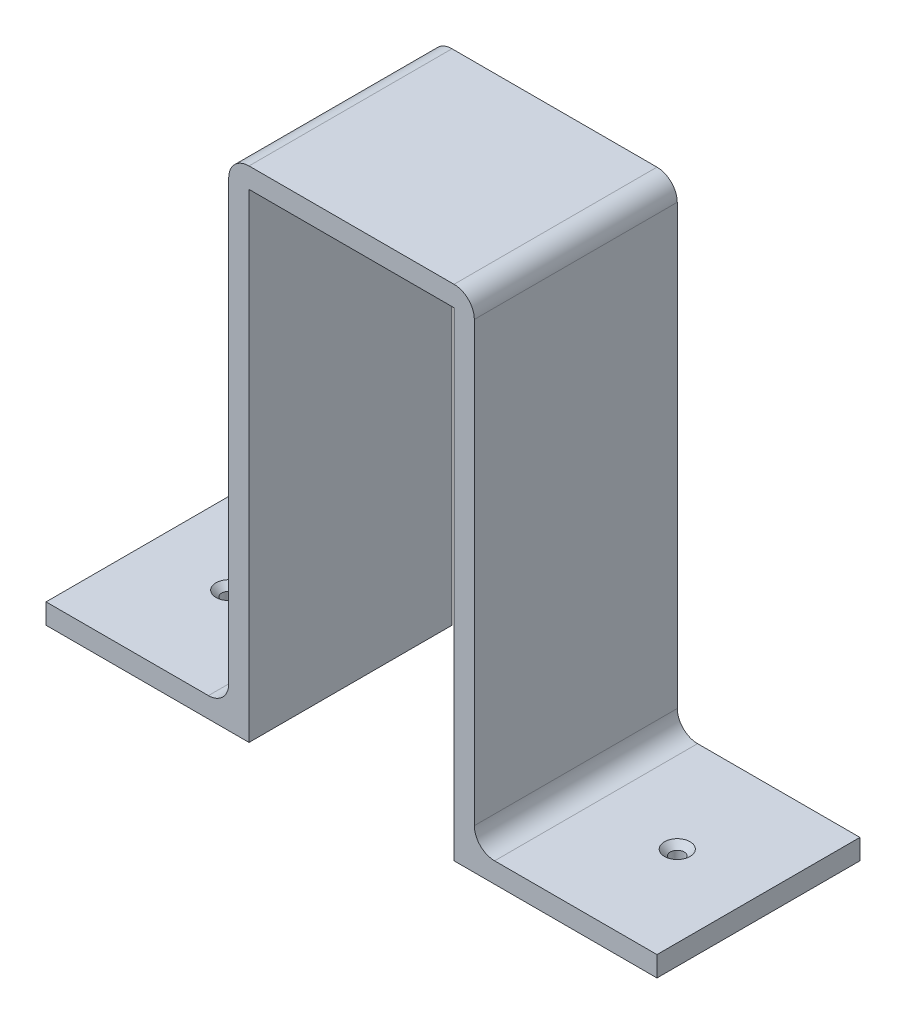
ISO-10303-21;
HEADER;
FILE_DESCRIPTION(('STEP AP214'),'2;1');
FILE_NAME('part.step','',(''),(''),'','','');
FILE_SCHEMA(('AUTOMOTIVE_DESIGN { 1 0 10303 214 1 1 1 1 }'));
ENDSEC;
DATA;
#1=APPLICATION_CONTEXT('core data for automotive mechanical design processes');
#2=APPLICATION_PROTOCOL_DEFINITION('international standard','automotive_design',2000,#1);
#3=PRODUCT_CONTEXT('',#1,'mechanical');
#4=PRODUCT('Part','Part','',(#3));
#5=PRODUCT_RELATED_PRODUCT_CATEGORY('part','',(#4));
#6=PRODUCT_DEFINITION_FORMATION('','',#4);
#7=PRODUCT_DEFINITION_CONTEXT('part definition',#1,'design');
#8=PRODUCT_DEFINITION('design','',#6,#7);
#9=PRODUCT_DEFINITION_SHAPE('','',#8);
#10=(LENGTH_UNIT() NAMED_UNIT(*) SI_UNIT(.MILLI.,.METRE.));
#11=(NAMED_UNIT(*) PLANE_ANGLE_UNIT() SI_UNIT($,.RADIAN.));
#12=(NAMED_UNIT(*) SI_UNIT($,.STERADIAN.) SOLID_ANGLE_UNIT());
#13=UNCERTAINTY_MEASURE_WITH_UNIT(LENGTH_MEASURE(1.E-05),#10,'distance_accuracy_value','');
#14=(GEOMETRIC_REPRESENTATION_CONTEXT(3) GLOBAL_UNCERTAINTY_ASSIGNED_CONTEXT((#13)) GLOBAL_UNIT_ASSIGNED_CONTEXT((#10,
#11,#12)) REPRESENTATION_CONTEXT('',''));
#15=CARTESIAN_POINT('',(0.,0.,0.));
#16=DIRECTION('',(0.,0.,1.));
#17=DIRECTION('',(1.,0.,0.));
#18=AXIS2_PLACEMENT_3D('',#15,#16,#17);
#19=CARTESIAN_POINT('',(-25.25,-118.,50.));
#20=DIRECTION('',(0.,1.,0.));
#21=DIRECTION('',(0.,0.,1.));
#22=AXIS2_PLACEMENT_3D('',#19,#20,#21);
#23=PLANE('',#22);
#24=CARTESIAN_POINT('',(-55.25,-118.,25.));
#25=DIRECTION('',(0.,1.,0.));
#26=DIRECTION('',(0.,0.,1.));
#27=AXIS2_PLACEMENT_3D('',#24,#25,#26);
#28=CIRCLE('',#27,1.7);
#29=CARTESIAN_POINT('',(-55.25,-118.,26.7));
#30=VERTEX_POINT('',#29);
#31=EDGE_CURVE('E309',#30,#30,#28,.T.);
#32=ORIENTED_EDGE('',*,*,#31,.T.);
#33=EDGE_LOOP('',(#32));
#34=FACE_BOUND('',#33,.T.);
#35=DIRECTION('',(1.,0.,0.));
#36=VECTOR('',#35,1.);
#37=CARTESIAN_POINT('',(-25.25,-118.,0.));
#38=LINE('',#37,#36);
#39=CARTESIAN_POINT('',(-75.25,-118.,0.));
#40=VERTEX_POINT('',#39);
#41=CARTESIAN_POINT('',(-25.25,-118.,0.));
#42=VERTEX_POINT('',#41);
#43=EDGE_CURVE('E169',#40,#42,#38,.T.);
#44=ORIENTED_EDGE('',*,*,#43,.T.);
#45=DIRECTION('',(0.,0.,-1.));
#46=VECTOR('',#45,1.);
#47=CARTESIAN_POINT('',(-25.25,-118.,50.));
#48=LINE('',#47,#46);
#49=CARTESIAN_POINT('',(-25.25,-118.,50.));
#50=VERTEX_POINT('',#49);
#51=EDGE_CURVE('E151',#50,#42,#48,.T.);
#52=ORIENTED_EDGE('',*,*,#51,.F.);
#53=DIRECTION('',(1.,0.,0.));
#54=VECTOR('',#53,1.);
#55=CARTESIAN_POINT('',(-25.25,-118.,50.));
#56=LINE('',#55,#54);
#57=CARTESIAN_POINT('',(-75.25,-118.,50.));
#58=VERTEX_POINT('',#57);
#59=EDGE_CURVE('E157',#58,#50,#56,.T.);
#60=ORIENTED_EDGE('',*,*,#59,.F.);
#61=DIRECTION('',(0.,0.,-1.));
#62=VECTOR('',#61,1.);
#63=CARTESIAN_POINT('',(-75.25,-118.,50.));
#64=LINE('',#63,#62);
#65=EDGE_CURVE('E247',#58,#40,#64,.T.);
#66=ORIENTED_EDGE('',*,*,#65,.T.);
#67=EDGE_LOOP('',(#44,#52,#60,#66));
#68=FACE_BOUND('',#67,.T.);
#69=ADVANCED_FACE('F33',(#34,#68),#23,.F.);
#70=CARTESIAN_POINT('',(-25.25,0.,50.));
#71=DIRECTION('',(-1.,0.,0.));
#72=DIRECTION('',(0.,-1.,0.));
#73=AXIS2_PLACEMENT_3D('',#70,#71,#72);
#74=PLANE('',#73);
#75=DIRECTION('',(0.,1.,0.));
#76=VECTOR('',#75,1.);
#77=CARTESIAN_POINT('',(-25.25,0.,0.));
#78=LINE('',#77,#76);
#79=CARTESIAN_POINT('',(-25.25,0.,0.));
#80=VERTEX_POINT('',#79);
#81=EDGE_CURVE('E249',#42,#80,#78,.T.);
#82=ORIENTED_EDGE('',*,*,#81,.T.);
#83=DIRECTION('',(0.,0.,-1.));
#84=VECTOR('',#83,1.);
#85=CARTESIAN_POINT('',(-25.25,0.,50.));
#86=LINE('',#85,#84);
#87=CARTESIAN_POINT('',(-25.25,0.,50.));
#88=VERTEX_POINT('',#87);
#89=EDGE_CURVE('E154',#88,#80,#86,.T.);
#90=ORIENTED_EDGE('',*,*,#89,.F.);
#91=DIRECTION('',(0.,1.,0.));
#92=VECTOR('',#91,1.);
#93=CARTESIAN_POINT('',(-25.25,0.,50.));
#94=LINE('',#93,#92);
#95=EDGE_CURVE('E147',#50,#88,#94,.T.);
#96=ORIENTED_EDGE('',*,*,#95,.F.);
#97=ORIENTED_EDGE('',*,*,#51,.T.);
#98=EDGE_LOOP('',(#82,#90,#96,#97));
#99=FACE_BOUND('',#98,.T.);
#100=ADVANCED_FACE('F149',(#99),#74,.F.);
#101=CARTESIAN_POINT('',(-25.25,0.,50.));
#102=DIRECTION('',(0.,1.,0.));
#103=DIRECTION('',(0.,0.,1.));
#104=AXIS2_PLACEMENT_3D('',#101,#102,#103);
#105=PLANE('',#104);
#106=DIRECTION('',(1.,0.,0.));
#107=VECTOR('',#106,1.);
#108=CARTESIAN_POINT('',(-25.25,0.,0.));
#109=LINE('',#108,#107);
#110=CARTESIAN_POINT('',(25.25,0.,0.));
#111=VERTEX_POINT('',#110);
#112=EDGE_CURVE('E252',#80,#111,#109,.T.);
#113=ORIENTED_EDGE('',*,*,#112,.T.);
#114=DIRECTION('',(0.,0.,-1.));
#115=VECTOR('',#114,1.);
#116=CARTESIAN_POINT('',(25.25,0.,50.));
#117=LINE('',#116,#115);
#118=CARTESIAN_POINT('',(25.25,0.,50.));
#119=VERTEX_POINT('',#118);
#120=EDGE_CURVE('E175',#119,#111,#117,.T.);
#121=ORIENTED_EDGE('',*,*,#120,.F.);
#122=DIRECTION('',(1.,0.,0.));
#123=VECTOR('',#122,1.);
#124=CARTESIAN_POINT('',(-25.25,0.,50.));
#125=LINE('',#124,#123);
#126=EDGE_CURVE('E156',#88,#119,#125,.T.);
#127=ORIENTED_EDGE('',*,*,#126,.F.);
#128=ORIENTED_EDGE('',*,*,#89,.T.);
#129=EDGE_LOOP('',(#113,#121,#127,#128));
#130=FACE_BOUND('',#129,.T.);
#131=ADVANCED_FACE('F359',(#130),#105,.F.);
#132=CARTESIAN_POINT('',(25.25,0.,50.));
#133=DIRECTION('',(1.,0.,0.));
#134=DIRECTION('',(0.,1.,0.));
#135=AXIS2_PLACEMENT_3D('',#132,#133,#134);
#136=PLANE('',#135);
#137=DIRECTION('',(0.,-1.,0.));
#138=VECTOR('',#137,1.);
#139=CARTESIAN_POINT('',(25.25,0.,0.));
#140=LINE('',#139,#138);
#141=CARTESIAN_POINT('',(25.25,-118.,0.));
#142=VERTEX_POINT('',#141);
#143=EDGE_CURVE('E254',#111,#142,#140,.T.);
#144=ORIENTED_EDGE('',*,*,#143,.T.);
#145=DIRECTION('',(0.,0.,-1.));
#146=VECTOR('',#145,1.);
#147=CARTESIAN_POINT('',(25.25,-118.,50.));
#148=LINE('',#147,#146);
#149=CARTESIAN_POINT('',(25.25,-118.,50.));
#150=VERTEX_POINT('',#149);
#151=EDGE_CURVE('E276',#150,#142,#148,.T.);
#152=ORIENTED_EDGE('',*,*,#151,.F.);
#153=DIRECTION('',(0.,-1.,0.));
#154=VECTOR('',#153,1.);
#155=CARTESIAN_POINT('',(25.25,0.,50.));
#156=LINE('',#155,#154);
#157=EDGE_CURVE('E285',#119,#150,#156,.T.);
#158=ORIENTED_EDGE('',*,*,#157,.F.);
#159=ORIENTED_EDGE('',*,*,#120,.T.);
#160=EDGE_LOOP('',(#144,#152,#158,#159));
#161=FACE_BOUND('',#160,.T.);
#162=ADVANCED_FACE('F283',(#161),#136,.F.);
#163=CARTESIAN_POINT('',(25.25,-118.,50.));
#164=DIRECTION('',(0.,1.,0.));
#165=DIRECTION('',(0.,0.,1.));
#166=AXIS2_PLACEMENT_3D('',#163,#164,#165);
#167=PLANE('',#166);
#168=CARTESIAN_POINT('',(55.25,-118.,25.));
#169=DIRECTION('',(0.,1.,0.));
#170=DIRECTION('',(0.,0.,1.));
#171=AXIS2_PLACEMENT_3D('',#168,#169,#170);
#172=CIRCLE('',#171,1.7);
#173=CARTESIAN_POINT('',(55.25,-118.,26.7));
#174=VERTEX_POINT('',#173);
#175=EDGE_CURVE('E250',#174,#174,#172,.T.);
#176=ORIENTED_EDGE('',*,*,#175,.T.);
#177=EDGE_LOOP('',(#176));
#178=FACE_BOUND('',#177,.T.);
#179=DIRECTION('',(1.,0.,0.));
#180=VECTOR('',#179,1.);
#181=CARTESIAN_POINT('',(25.25,-118.,0.));
#182=LINE('',#181,#180);
#183=CARTESIAN_POINT('',(75.25,-118.,0.));
#184=VERTEX_POINT('',#183);
#185=EDGE_CURVE('E256',#142,#184,#182,.T.);
#186=ORIENTED_EDGE('',*,*,#185,.T.);
#187=DIRECTION('',(0.,0.,-1.));
#188=VECTOR('',#187,1.);
#189=CARTESIAN_POINT('',(75.25,-118.,50.));
#190=LINE('',#189,#188);
#191=CARTESIAN_POINT('',(75.25,-118.,50.));
#192=VERTEX_POINT('',#191);
#193=EDGE_CURVE('E273',#192,#184,#190,.T.);
#194=ORIENTED_EDGE('',*,*,#193,.F.);
#195=DIRECTION('',(1.,0.,0.));
#196=VECTOR('',#195,1.);
#197=CARTESIAN_POINT('',(25.25,-118.,50.));
#198=LINE('',#197,#196);
#199=EDGE_CURVE('E296',#150,#192,#198,.T.);
#200=ORIENTED_EDGE('',*,*,#199,.F.);
#201=ORIENTED_EDGE('',*,*,#151,.T.);
#202=EDGE_LOOP('',(#186,#194,#200,#201));
#203=FACE_BOUND('',#202,.T.);
#204=ADVANCED_FACE('F291',(#178,#203),#167,.F.);
#205=CARTESIAN_POINT('',(75.25,-118.,50.));
#206=DIRECTION('',(-1.,0.,0.));
#207=DIRECTION('',(0.,0.,1.));
#208=AXIS2_PLACEMENT_3D('',#205,#206,#207);
#209=PLANE('',#208);
#210=DIRECTION('',(0.,1.,0.));
#211=VECTOR('',#210,1.);
#212=CARTESIAN_POINT('',(75.25,-118.,0.));
#213=LINE('',#212,#211);
#214=CARTESIAN_POINT('',(75.25,-113.,0.));
#215=VERTEX_POINT('',#214);
#216=EDGE_CURVE('E224',#184,#215,#213,.T.);
#217=ORIENTED_EDGE('',*,*,#216,.T.);
#218=DIRECTION('',(0.,0.,-1.));
#219=VECTOR('',#218,1.);
#220=CARTESIAN_POINT('',(75.25,-113.,50.));
#221=LINE('',#220,#219);
#222=CARTESIAN_POINT('',(75.25,-113.,50.));
#223=VERTEX_POINT('',#222);
#224=EDGE_CURVE('E223',#223,#215,#221,.T.);
#225=ORIENTED_EDGE('',*,*,#224,.F.);
#226=DIRECTION('',(0.,1.,0.));
#227=VECTOR('',#226,1.);
#228=CARTESIAN_POINT('',(75.25,-118.,50.));
#229=LINE('',#228,#227);
#230=EDGE_CURVE('E238',#192,#223,#229,.T.);
#231=ORIENTED_EDGE('',*,*,#230,.F.);
#232=ORIENTED_EDGE('',*,*,#193,.T.);
#233=EDGE_LOOP('',(#217,#225,#231,#232));
#234=FACE_BOUND('',#233,.T.);
#235=ADVANCED_FACE('F295',(#234),#209,.F.);
#236=CARTESIAN_POINT('',(30.25,-113.,50.));
#237=DIRECTION('',(0.,-1.,0.));
#238=DIRECTION('',(1.,0.,0.));
#239=AXIS2_PLACEMENT_3D('',#236,#237,#238);
#240=PLANE('',#239);
#241=CARTESIAN_POINT('',(55.25,-113.,25.));
#242=DIRECTION('',(0.,1.,0.));
#243=DIRECTION('',(0.,0.,1.));
#244=AXIS2_PLACEMENT_3D('',#241,#242,#243);
#245=CIRCLE('',#244,3.15);
#246=CARTESIAN_POINT('',(55.25,-113.,28.15));
#247=VERTEX_POINT('',#246);
#248=EDGE_CURVE('E306',#247,#247,#245,.T.);
#249=ORIENTED_EDGE('',*,*,#248,.F.);
#250=EDGE_LOOP('',(#249));
#251=FACE_BOUND('',#250,.T.);
#252=DIRECTION('',(-1.,0.,0.));
#253=VECTOR('',#252,1.);
#254=CARTESIAN_POINT('',(30.25,-113.,0.));
#255=LINE('',#254,#253);
#256=CARTESIAN_POINT('',(35.25,-113.,0.));
#257=VERTEX_POINT('',#256);
#258=EDGE_CURVE('E211',#215,#257,#255,.T.);
#259=ORIENTED_EDGE('',*,*,#258,.T.);
#260=DIRECTION('',(0.,0.,-1.));
#261=VECTOR('',#260,1.);
#262=CARTESIAN_POINT('',(35.25,-113.,50.));
#263=LINE('',#262,#261);
#264=CARTESIAN_POINT('',(35.25,-113.,50.));
#265=VERTEX_POINT('',#264);
#266=EDGE_CURVE('E188',#257,#265,#263,.F.);
#267=ORIENTED_EDGE('',*,*,#266,.T.);
#268=DIRECTION('',(-1.,0.,0.));
#269=VECTOR('',#268,1.);
#270=CARTESIAN_POINT('',(30.25,-113.,50.));
#271=LINE('',#270,#269);
#272=EDGE_CURVE('E230',#223,#265,#271,.T.);
#273=ORIENTED_EDGE('',*,*,#272,.F.);
#274=ORIENTED_EDGE('',*,*,#224,.T.);
#275=EDGE_LOOP('',(#259,#267,#273,#274));
#276=FACE_BOUND('',#275,.T.);
#277=ADVANCED_FACE('F219',(#251,#276),#240,.F.);
#278=CARTESIAN_POINT('',(30.25,5.,50.));
#279=DIRECTION('',(-1.,0.,0.));
#280=DIRECTION('',(0.,-1.,0.));
#281=AXIS2_PLACEMENT_3D('',#278,#279,#280);
#282=PLANE('',#281);
#283=DIRECTION('',(0.,1.,0.));
#284=VECTOR('',#283,1.);
#285=CARTESIAN_POINT('',(30.25,5.,50.));
#286=LINE('',#285,#284);
#287=CARTESIAN_POINT('',(30.25,-108.,50.));
#288=VERTEX_POINT('',#287);
#289=CARTESIAN_POINT('',(30.25,0.,50.));
#290=VERTEX_POINT('',#289);
#291=EDGE_CURVE('E229',#288,#290,#286,.T.);
#292=ORIENTED_EDGE('',*,*,#291,.F.);
#293=DIRECTION('',(0.,0.,-1.));
#294=VECTOR('',#293,1.);
#295=CARTESIAN_POINT('',(30.25,-108.,0.));
#296=LINE('',#295,#294);
#297=CARTESIAN_POINT('',(30.25,-108.,0.));
#298=VERTEX_POINT('',#297);
#299=EDGE_CURVE('E185',#288,#298,#296,.T.);
#300=ORIENTED_EDGE('',*,*,#299,.T.);
#301=DIRECTION('',(0.,1.,0.));
#302=VECTOR('',#301,1.);
#303=CARTESIAN_POINT('',(30.25,5.,0.));
#304=LINE('',#303,#302);
#305=CARTESIAN_POINT('',(30.25,0.,0.));
#306=VERTEX_POINT('',#305);
#307=EDGE_CURVE('E213',#298,#306,#304,.T.);
#308=ORIENTED_EDGE('',*,*,#307,.T.);
#309=DIRECTION('',(0.,0.,-1.));
#310=VECTOR('',#309,1.);
#311=CARTESIAN_POINT('',(30.25,0.,50.));
#312=LINE('',#311,#310);
#313=EDGE_CURVE('E183',#306,#290,#312,.F.);
#314=ORIENTED_EDGE('',*,*,#313,.T.);
#315=EDGE_LOOP('',(#292,#300,#308,#314));
#316=FACE_BOUND('',#315,.T.);
#317=ADVANCED_FACE('F232',(#316),#282,.F.);
#318=CARTESIAN_POINT('',(-30.25,5.,50.));
#319=DIRECTION('',(0.,-1.,0.));
#320=DIRECTION('',(0.,0.,-1.));
#321=AXIS2_PLACEMENT_3D('',#318,#319,#320);
#322=PLANE('',#321);
#323=DIRECTION('',(-1.,0.,0.));
#324=VECTOR('',#323,1.);
#325=CARTESIAN_POINT('',(-30.25,5.,50.));
#326=LINE('',#325,#324);
#327=CARTESIAN_POINT('',(25.25,5.,50.));
#328=VERTEX_POINT('',#327);
#329=CARTESIAN_POINT('',(-25.25,5.,50.));
#330=VERTEX_POINT('',#329);
#331=EDGE_CURVE('E234',#328,#330,#326,.T.);
#332=ORIENTED_EDGE('',*,*,#331,.F.);
#333=DIRECTION('',(0.,0.,-1.));
#334=VECTOR('',#333,1.);
#335=CARTESIAN_POINT('',(25.25,5.,50.));
#336=LINE('',#335,#334);
#337=CARTESIAN_POINT('',(25.25,5.,0.));
#338=VERTEX_POINT('',#337);
#339=EDGE_CURVE('E191',#328,#338,#336,.T.);
#340=ORIENTED_EDGE('',*,*,#339,.T.);
#341=DIRECTION('',(-1.,0.,0.));
#342=VECTOR('',#341,1.);
#343=CARTESIAN_POINT('',(-30.25,5.,0.));
#344=LINE('',#343,#342);
#345=CARTESIAN_POINT('',(-25.25,5.,0.));
#346=VERTEX_POINT('',#345);
#347=EDGE_CURVE('E260',#338,#346,#344,.T.);
#348=ORIENTED_EDGE('',*,*,#347,.T.);
#349=DIRECTION('',(0.,0.,-1.));
#350=VECTOR('',#349,1.);
#351=CARTESIAN_POINT('',(-25.25,5.,50.));
#352=LINE('',#351,#350);
#353=EDGE_CURVE('E48',#346,#330,#352,.F.);
#354=ORIENTED_EDGE('',*,*,#353,.T.);
#355=EDGE_LOOP('',(#332,#340,#348,#354));
#356=FACE_BOUND('',#355,.T.);
#357=ADVANCED_FACE('F342',(#356),#322,.F.);
#358=CARTESIAN_POINT('',(-30.25,5.,50.));
#359=DIRECTION('',(1.,0.,0.));
#360=DIRECTION('',(0.,1.,0.));
#361=AXIS2_PLACEMENT_3D('',#358,#359,#360);
#362=PLANE('',#361);
#363=DIRECTION('',(0.,-1.,0.));
#364=VECTOR('',#363,1.);
#365=CARTESIAN_POINT('',(-30.25,5.,0.));
#366=LINE('',#365,#364);
#367=CARTESIAN_POINT('',(-30.25,0.,0.));
#368=VERTEX_POINT('',#367);
#369=CARTESIAN_POINT('',(-30.25,-108.,0.));
#370=VERTEX_POINT('',#369);
#371=EDGE_CURVE('E262',#368,#370,#366,.T.);
#372=ORIENTED_EDGE('',*,*,#371,.T.);
#373=DIRECTION('',(0.,0.,-1.));
#374=VECTOR('',#373,1.);
#375=CARTESIAN_POINT('',(-30.25,-108.,50.));
#376=LINE('',#375,#374);
#377=CARTESIAN_POINT('',(-30.25,-108.,50.));
#378=VERTEX_POINT('',#377);
#379=EDGE_CURVE('E181',#370,#378,#376,.F.);
#380=ORIENTED_EDGE('',*,*,#379,.T.);
#381=DIRECTION('',(0.,-1.,0.));
#382=VECTOR('',#381,1.);
#383=CARTESIAN_POINT('',(-30.25,5.,50.));
#384=LINE('',#383,#382);
#385=CARTESIAN_POINT('',(-30.25,0.,50.));
#386=VERTEX_POINT('',#385);
#387=EDGE_CURVE('E236',#386,#378,#384,.T.);
#388=ORIENTED_EDGE('',*,*,#387,.F.);
#389=DIRECTION('',(0.,0.,-1.));
#390=VECTOR('',#389,1.);
#391=CARTESIAN_POINT('',(-30.25,0.,50.));
#392=LINE('',#391,#390);
#393=EDGE_CURVE('E173',#386,#368,#392,.T.);
#394=ORIENTED_EDGE('',*,*,#393,.T.);
#395=EDGE_LOOP('',(#372,#380,#388,#394));
#396=FACE_BOUND('',#395,.T.);
#397=ADVANCED_FACE('F325',(#396),#362,.F.);
#398=CARTESIAN_POINT('',(-30.25,-113.,50.));
#399=DIRECTION('',(0.,-1.,0.));
#400=DIRECTION('',(0.,0.,-1.));
#401=AXIS2_PLACEMENT_3D('',#398,#399,#400);
#402=PLANE('',#401);
#403=CARTESIAN_POINT('',(-55.25,-113.,25.));
#404=DIRECTION('',(0.,1.,0.));
#405=DIRECTION('',(0.,0.,1.));
#406=AXIS2_PLACEMENT_3D('',#403,#404,#405);
#407=CIRCLE('',#406,3.15);
#408=CARTESIAN_POINT('',(-55.25,-113.,28.15));
#409=VERTEX_POINT('',#408);
#410=EDGE_CURVE('E315',#409,#409,#407,.T.);
#411=ORIENTED_EDGE('',*,*,#410,.F.);
#412=EDGE_LOOP('',(#411));
#413=FACE_BOUND('',#412,.T.);
#414=DIRECTION('',(-1.,0.,0.));
#415=VECTOR('',#414,1.);
#416=CARTESIAN_POINT('',(-30.25,-113.,50.));
#417=LINE('',#416,#415);
#418=CARTESIAN_POINT('',(-35.25,-113.,50.));
#419=VERTEX_POINT('',#418);
#420=CARTESIAN_POINT('',(-75.25,-113.,50.));
#421=VERTEX_POINT('',#420);
#422=EDGE_CURVE('E244',#419,#421,#417,.T.);
#423=ORIENTED_EDGE('',*,*,#422,.F.);
#424=DIRECTION('',(0.,0.,-1.));
#425=VECTOR('',#424,1.);
#426=CARTESIAN_POINT('',(-35.25,-113.,0.));
#427=LINE('',#426,#425);
#428=CARTESIAN_POINT('',(-35.25,-113.,0.));
#429=VERTEX_POINT('',#428);
#430=EDGE_CURVE('E170',#419,#429,#427,.T.);
#431=ORIENTED_EDGE('',*,*,#430,.T.);
#432=DIRECTION('',(-1.,0.,0.));
#433=VECTOR('',#432,1.);
#434=CARTESIAN_POINT('',(-30.25,-113.,0.));
#435=LINE('',#434,#433);
#436=CARTESIAN_POINT('',(-75.25,-113.,0.));
#437=VERTEX_POINT('',#436);
#438=EDGE_CURVE('E265',#429,#437,#435,.T.);
#439=ORIENTED_EDGE('',*,*,#438,.T.);
#440=DIRECTION('',(0.,0.,-1.));
#441=VECTOR('',#440,1.);
#442=CARTESIAN_POINT('',(-75.25,-113.,50.));
#443=LINE('',#442,#441);
#444=EDGE_CURVE('E269',#421,#437,#443,.T.);
#445=ORIENTED_EDGE('',*,*,#444,.F.);
#446=EDGE_LOOP('',(#423,#431,#439,#445));
#447=FACE_BOUND('',#446,.T.);
#448=ADVANCED_FACE('F321',(#413,#447),#402,.F.);
#449=CARTESIAN_POINT('',(-75.25,-118.,50.));
#450=DIRECTION('',(1.,0.,0.));
#451=DIRECTION('',(0.,0.,-1.));
#452=AXIS2_PLACEMENT_3D('',#449,#450,#451);
#453=PLANE('',#452);
#454=DIRECTION('',(0.,-1.,0.));
#455=VECTOR('',#454,1.);
#456=CARTESIAN_POINT('',(-75.25,-118.,0.));
#457=LINE('',#456,#455);
#458=EDGE_CURVE('E166',#437,#40,#457,.T.);
#459=ORIENTED_EDGE('',*,*,#458,.T.);
#460=ORIENTED_EDGE('',*,*,#65,.F.);
#461=DIRECTION('',(0.,-1.,0.));
#462=VECTOR('',#461,1.);
#463=CARTESIAN_POINT('',(-75.25,-118.,50.));
#464=LINE('',#463,#462);
#465=EDGE_CURVE('E162',#421,#58,#464,.T.);
#466=ORIENTED_EDGE('',*,*,#465,.F.);
#467=ORIENTED_EDGE('',*,*,#444,.T.);
#468=EDGE_LOOP('',(#459,#460,#466,#467));
#469=FACE_BOUND('',#468,.T.);
#470=ADVANCED_FACE('F324',(#469),#453,.F.);
#471=CARTESIAN_POINT('',(0.,0.,50.));
#472=DIRECTION('',(0.,0.,-1.));
#473=DIRECTION('',(-1.,0.,0.));
#474=AXIS2_PLACEMENT_3D('',#471,#472,#473);
#475=PLANE('',#474);
#476=ORIENTED_EDGE('',*,*,#291,.T.);
#477=CARTESIAN_POINT('',(25.25,0.,50.));
#478=DIRECTION('',(0.,0.,-1.));
#479=DIRECTION('',(-1.,0.,0.));
#480=AXIS2_PLACEMENT_3D('',#477,#478,#479);
#481=CIRCLE('',#480,5.);
#482=EDGE_CURVE('E55',#290,#328,#481,.F.);
#483=ORIENTED_EDGE('',*,*,#482,.T.);
#484=ORIENTED_EDGE('',*,*,#331,.T.);
#485=CARTESIAN_POINT('',(-25.25,0.,50.));
#486=DIRECTION('',(0.,0.,-1.));
#487=DIRECTION('',(-1.,0.,0.));
#488=AXIS2_PLACEMENT_3D('',#485,#486,#487);
#489=CIRCLE('',#488,5.);
#490=EDGE_CURVE('E198',#330,#386,#489,.F.);
#491=ORIENTED_EDGE('',*,*,#490,.T.);
#492=ORIENTED_EDGE('',*,*,#387,.T.);
#493=CARTESIAN_POINT('',(-35.25,-108.,50.));
#494=DIRECTION('',(0.,0.,-1.));
#495=DIRECTION('',(-1.,0.,0.));
#496=AXIS2_PLACEMENT_3D('',#493,#494,#495);
#497=CIRCLE('',#496,5.);
#498=EDGE_CURVE('E203',#378,#419,#497,.T.);
#499=ORIENTED_EDGE('',*,*,#498,.T.);
#500=ORIENTED_EDGE('',*,*,#422,.T.);
#501=ORIENTED_EDGE('',*,*,#465,.T.);
#502=ORIENTED_EDGE('',*,*,#59,.T.);
#503=ORIENTED_EDGE('',*,*,#95,.T.);
#504=ORIENTED_EDGE('',*,*,#126,.T.);
#505=ORIENTED_EDGE('',*,*,#157,.T.);
#506=ORIENTED_EDGE('',*,*,#199,.T.);
#507=ORIENTED_EDGE('',*,*,#230,.T.);
#508=ORIENTED_EDGE('',*,*,#272,.T.);
#509=CARTESIAN_POINT('',(35.25,-108.,50.));
#510=DIRECTION('',(0.,0.,-1.));
#511=DIRECTION('',(-1.,0.,0.));
#512=AXIS2_PLACEMENT_3D('',#509,#510,#511);
#513=CIRCLE('',#512,5.);
#514=EDGE_CURVE('E11',#265,#288,#513,.T.);
#515=ORIENTED_EDGE('',*,*,#514,.T.);
#516=EDGE_LOOP('',(#476,#483,#484,#491,#492,#499,#500,#501,#502,#503,#504,#505,#506,#507,#508,#515));
#517=FACE_BOUND('',#516,.T.);
#518=ADVANCED_FACE('F160',(#517),#475,.F.);
#519=CARTESIAN_POINT('',(0.,0.,0.));
#520=DIRECTION('',(0.,0.,-1.));
#521=DIRECTION('',(-1.,0.,0.));
#522=AXIS2_PLACEMENT_3D('',#519,#520,#521);
#523=PLANE('',#522);
#524=ORIENTED_EDGE('',*,*,#347,.F.);
#525=CARTESIAN_POINT('',(25.25,0.,0.));
#526=DIRECTION('',(0.,0.,-1.));
#527=DIRECTION('',(-1.,0.,0.));
#528=AXIS2_PLACEMENT_3D('',#525,#526,#527);
#529=CIRCLE('',#528,5.);
#530=EDGE_CURVE('E196',#338,#306,#529,.T.);
#531=ORIENTED_EDGE('',*,*,#530,.T.);
#532=ORIENTED_EDGE('',*,*,#307,.F.);
#533=CARTESIAN_POINT('',(35.25,-108.,0.));
#534=DIRECTION('',(0.,0.,-1.));
#535=DIRECTION('',(-1.,0.,0.));
#536=AXIS2_PLACEMENT_3D('',#533,#534,#535);
#537=CIRCLE('',#536,5.);
#538=EDGE_CURVE('E41',#298,#257,#537,.F.);
#539=ORIENTED_EDGE('',*,*,#538,.T.);
#540=ORIENTED_EDGE('',*,*,#258,.F.);
#541=ORIENTED_EDGE('',*,*,#216,.F.);
#542=ORIENTED_EDGE('',*,*,#185,.F.);
#543=ORIENTED_EDGE('',*,*,#143,.F.);
#544=ORIENTED_EDGE('',*,*,#112,.F.);
#545=ORIENTED_EDGE('',*,*,#81,.F.);
#546=ORIENTED_EDGE('',*,*,#43,.F.);
#547=ORIENTED_EDGE('',*,*,#458,.F.);
#548=ORIENTED_EDGE('',*,*,#438,.F.);
#549=CARTESIAN_POINT('',(-35.25,-108.,0.));
#550=DIRECTION('',(0.,0.,-1.));
#551=DIRECTION('',(-1.,0.,0.));
#552=AXIS2_PLACEMENT_3D('',#549,#550,#551);
#553=CIRCLE('',#552,5.);
#554=EDGE_CURVE('E201',#429,#370,#553,.F.);
#555=ORIENTED_EDGE('',*,*,#554,.T.);
#556=ORIENTED_EDGE('',*,*,#371,.F.);
#557=CARTESIAN_POINT('',(-25.25,0.,0.));
#558=DIRECTION('',(0.,0.,-1.));
#559=DIRECTION('',(-1.,0.,0.));
#560=AXIS2_PLACEMENT_3D('',#557,#558,#559);
#561=CIRCLE('',#560,5.);
#562=EDGE_CURVE('E194',#368,#346,#561,.T.);
#563=ORIENTED_EDGE('',*,*,#562,.T.);
#564=EDGE_LOOP('',(#524,#531,#532,#539,#540,#541,#542,#543,#544,#545,#546,#547,#548,#555,#556,#563));
#565=FACE_BOUND('',#564,.T.);
#566=ADVANCED_FACE('F209',(#565),#523,.T.);
#567=CARTESIAN_POINT('',(-35.25,-108.,50.));
#568=DIRECTION('',(0.,0.,1.));
#569=DIRECTION('',(1.,0.,0.));
#570=AXIS2_PLACEMENT_3D('',#567,#568,#569);
#571=CYLINDRICAL_SURFACE('',#570,5.);
#572=ORIENTED_EDGE('',*,*,#498,.F.);
#573=ORIENTED_EDGE('',*,*,#379,.F.);
#574=ORIENTED_EDGE('',*,*,#554,.F.);
#575=ORIENTED_EDGE('',*,*,#430,.F.);
#576=EDGE_LOOP('',(#572,#573,#574,#575));
#577=FACE_BOUND('',#576,.T.);
#578=ADVANCED_FACE('F333',(#577),#571,.F.);
#579=CARTESIAN_POINT('',(35.25,-108.,50.));
#580=DIRECTION('',(0.,0.,1.));
#581=DIRECTION('',(1.,0.,0.));
#582=AXIS2_PLACEMENT_3D('',#579,#580,#581);
#583=CYLINDRICAL_SURFACE('',#582,5.);
#584=ORIENTED_EDGE('',*,*,#514,.F.);
#585=ORIENTED_EDGE('',*,*,#266,.F.);
#586=ORIENTED_EDGE('',*,*,#538,.F.);
#587=ORIENTED_EDGE('',*,*,#299,.F.);
#588=EDGE_LOOP('',(#584,#585,#586,#587));
#589=FACE_BOUND('',#588,.T.);
#590=ADVANCED_FACE('F227',(#589),#583,.F.);
#591=CARTESIAN_POINT('',(25.25,0.,50.));
#592=DIRECTION('',(0.,0.,-1.));
#593=DIRECTION('',(-1.,0.,0.));
#594=AXIS2_PLACEMENT_3D('',#591,#592,#593);
#595=CYLINDRICAL_SURFACE('',#594,5.);
#596=ORIENTED_EDGE('',*,*,#482,.F.);
#597=ORIENTED_EDGE('',*,*,#313,.F.);
#598=ORIENTED_EDGE('',*,*,#530,.F.);
#599=ORIENTED_EDGE('',*,*,#339,.F.);
#600=EDGE_LOOP('',(#596,#597,#598,#599));
#601=FACE_BOUND('',#600,.T.);
#602=ADVANCED_FACE('F345',(#601),#595,.T.);
#603=CARTESIAN_POINT('',(-25.25,0.,50.));
#604=DIRECTION('',(0.,0.,-1.));
#605=DIRECTION('',(-1.,0.,0.));
#606=AXIS2_PLACEMENT_3D('',#603,#604,#605);
#607=CYLINDRICAL_SURFACE('',#606,5.);
#608=ORIENTED_EDGE('',*,*,#490,.F.);
#609=ORIENTED_EDGE('',*,*,#353,.F.);
#610=ORIENTED_EDGE('',*,*,#562,.F.);
#611=ORIENTED_EDGE('',*,*,#393,.F.);
#612=EDGE_LOOP('',(#608,#609,#610,#611));
#613=FACE_BOUND('',#612,.T.);
#614=ADVANCED_FACE('F35',(#613),#607,.T.);
#615=CARTESIAN_POINT('',(55.25,-113.,25.));
#616=DIRECTION('',(0.,1.,0.));
#617=DIRECTION('',(0.,0.,1.));
#618=AXIS2_PLACEMENT_3D('',#615,#616,#617);
#619=CYLINDRICAL_SURFACE('',#618,1.7);
#620=ORIENTED_EDGE('',*,*,#175,.F.);
#621=EDGE_LOOP('',(#620));
#622=FACE_BOUND('',#621,.T.);
#623=CARTESIAN_POINT('',(55.25,-114.45,25.));
#624=DIRECTION('',(0.,1.,0.));
#625=DIRECTION('',(0.,0.,1.));
#626=AXIS2_PLACEMENT_3D('',#623,#624,#625);
#627=CIRCLE('',#626,1.7);
#628=CARTESIAN_POINT('',(55.25,-114.45,26.7));
#629=VERTEX_POINT('',#628);
#630=EDGE_CURVE('E303',#629,#629,#627,.T.);
#631=ORIENTED_EDGE('',*,*,#630,.T.);
#632=EDGE_LOOP('',(#631));
#633=FACE_BOUND('',#632,.T.);
#634=ADVANCED_FACE('F351',(#622,#633),#619,.F.);
#635=CARTESIAN_POINT('',(55.25,-113.,25.));
#636=DIRECTION('',(0.,1.,0.));
#637=DIRECTION('',(0.,0.,1.));
#638=AXIS2_PLACEMENT_3D('',#635,#636,#637);
#639=CONICAL_SURFACE('',#638,3.15,0.785398163397446);
#640=ORIENTED_EDGE('',*,*,#630,.F.);
#641=EDGE_LOOP('',(#640));
#642=FACE_BOUND('',#641,.T.);
#643=ORIENTED_EDGE('',*,*,#248,.T.);
#644=EDGE_LOOP('',(#643));
#645=FACE_BOUND('',#644,.T.);
#646=ADVANCED_FACE('F498',(#642,#645),#639,.F.);
#647=CARTESIAN_POINT('',(-55.25,-113.,25.));
#648=DIRECTION('',(0.,1.,0.));
#649=DIRECTION('',(0.,0.,1.));
#650=AXIS2_PLACEMENT_3D('',#647,#648,#649);
#651=CYLINDRICAL_SURFACE('',#650,1.7);
#652=ORIENTED_EDGE('',*,*,#31,.F.);
#653=EDGE_LOOP('',(#652));
#654=FACE_BOUND('',#653,.T.);
#655=CARTESIAN_POINT('',(-55.25,-114.45,25.));
#656=DIRECTION('',(0.,1.,0.));
#657=DIRECTION('',(0.,0.,1.));
#658=AXIS2_PLACEMENT_3D('',#655,#656,#657);
#659=CIRCLE('',#658,1.7);
#660=CARTESIAN_POINT('',(-55.25,-114.45,26.7));
#661=VERTEX_POINT('',#660);
#662=EDGE_CURVE('E312',#661,#661,#659,.T.);
#663=ORIENTED_EDGE('',*,*,#662,.T.);
#664=EDGE_LOOP('',(#663));
#665=FACE_BOUND('',#664,.T.);
#666=ADVANCED_FACE('F504',(#654,#665),#651,.F.);
#667=CARTESIAN_POINT('',(-55.25,-113.,25.));
#668=DIRECTION('',(0.,1.,0.));
#669=DIRECTION('',(0.,0.,1.));
#670=AXIS2_PLACEMENT_3D('',#667,#668,#669);
#671=CONICAL_SURFACE('',#670,3.15,0.785398163397446);
#672=ORIENTED_EDGE('',*,*,#662,.F.);
#673=EDGE_LOOP('',(#672));
#674=FACE_BOUND('',#673,.T.);
#675=ORIENTED_EDGE('',*,*,#410,.T.);
#676=EDGE_LOOP('',(#675));
#677=FACE_BOUND('',#676,.T.);
#678=ADVANCED_FACE('F319',(#674,#677),#671,.F.);
#679=CLOSED_SHELL('',(#69,#100,#131,#162,#204,#235,#277,#317,#357,#397,#448,#470,#518,#566,#578,
#590,#602,#614,#634,#646,#666,#678));
#680=MANIFOLD_SOLID_BREP('B2',#679);
#681=ADVANCED_BREP_SHAPE_REPRESENTATION('',(#18,#680),#14);
#682=SHAPE_DEFINITION_REPRESENTATION(#9,#681);
ENDSEC;
END-ISO-10303-21;
